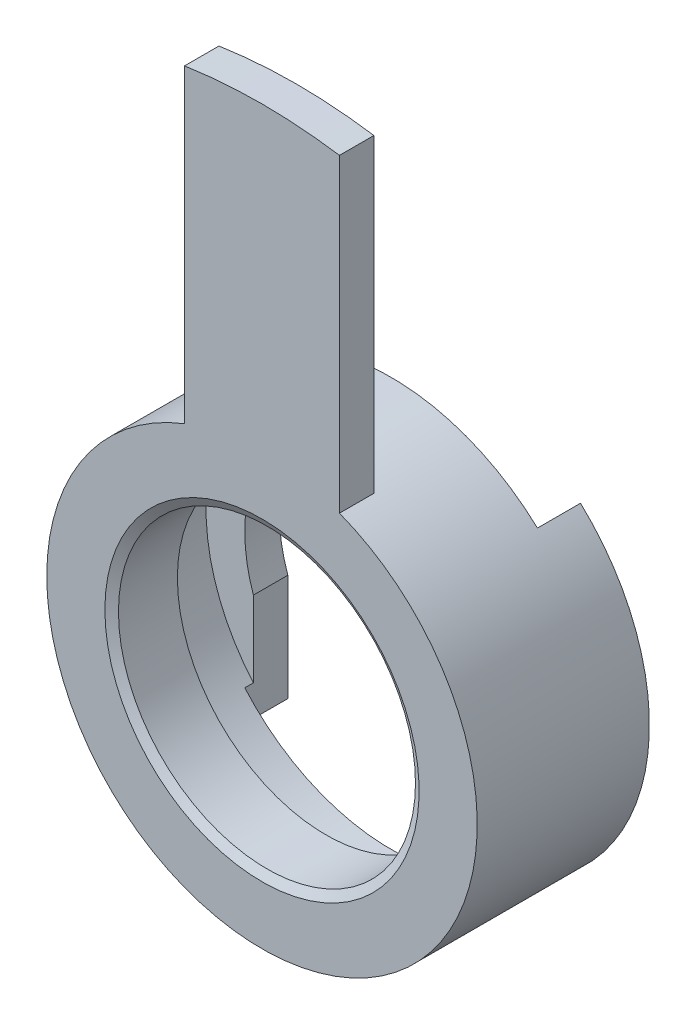
ISO-10303-21;
HEADER;
FILE_DESCRIPTION(('STEP AP214'),'2;1');
FILE_NAME('part.step','',(''),(''),'','','');
FILE_SCHEMA(('AUTOMOTIVE_DESIGN { 1 0 10303 214 1 1 1 1 }'));
ENDSEC;
DATA;
#1=APPLICATION_CONTEXT('core data for automotive mechanical design processes');
#2=APPLICATION_PROTOCOL_DEFINITION('international standard','automotive_design',2000,#1);
#3=PRODUCT_CONTEXT('',#1,'mechanical');
#4=PRODUCT('Part','Part','',(#3));
#5=PRODUCT_RELATED_PRODUCT_CATEGORY('part','',(#4));
#6=PRODUCT_DEFINITION_FORMATION('','',#4);
#7=PRODUCT_DEFINITION_CONTEXT('part definition',#1,'design');
#8=PRODUCT_DEFINITION('design','',#6,#7);
#9=PRODUCT_DEFINITION_SHAPE('','',#8);
#10=(LENGTH_UNIT() NAMED_UNIT(*) SI_UNIT(.MILLI.,.METRE.));
#11=(NAMED_UNIT(*) PLANE_ANGLE_UNIT() SI_UNIT($,.RADIAN.));
#12=(NAMED_UNIT(*) SI_UNIT($,.STERADIAN.) SOLID_ANGLE_UNIT());
#13=UNCERTAINTY_MEASURE_WITH_UNIT(LENGTH_MEASURE(1.E-05),#10,'distance_accuracy_value','');
#14=(GEOMETRIC_REPRESENTATION_CONTEXT(3) GLOBAL_UNCERTAINTY_ASSIGNED_CONTEXT((#13)) GLOBAL_UNIT_ASSIGNED_CONTEXT((#10,
#11,#12)) REPRESENTATION_CONTEXT('',''));
#15=CARTESIAN_POINT('',(0.,0.,0.));
#16=DIRECTION('',(0.,0.,1.));
#17=DIRECTION('',(1.,0.,0.));
#18=AXIS2_PLACEMENT_3D('',#15,#16,#17);
#19=CARTESIAN_POINT('',(0.,0.,0.));
#20=DIRECTION('',(0.,0.,1.));
#21=DIRECTION('',(1.,0.,0.));
#22=AXIS2_PLACEMENT_3D('',#19,#20,#21);
#23=CYLINDRICAL_SURFACE('',#22,25.);
#24=CARTESIAN_POINT('',(0.,0.,-4.));
#25=DIRECTION('',(0.,0.,1.));
#26=DIRECTION('',(1.,0.,0.));
#27=AXIS2_PLACEMENT_3D('',#24,#25,#26);
#28=CIRCLE('',#27,25.);
#29=CARTESIAN_POINT('',(9.,23.3238075793812,-4.));
#30=VERTEX_POINT('',#29);
#31=CARTESIAN_POINT('',(-9.,23.3238075793812,-4.));
#32=VERTEX_POINT('',#31);
#33=EDGE_CURVE('E247',#30,#32,#28,.T.);
#34=ORIENTED_EDGE('',*,*,#33,.F.);
#35=DIRECTION('',(0.,0.,1.));
#36=VECTOR('',#35,1.);
#37=CARTESIAN_POINT('',(9.,23.3238075793812,-5.));
#38=LINE('',#37,#36);
#39=CARTESIAN_POINT('',(9.,23.3238075793812,0.));
#40=VERTEX_POINT('',#39);
#41=EDGE_CURVE('E157',#30,#40,#38,.T.);
#42=ORIENTED_EDGE('',*,*,#41,.T.);
#43=CARTESIAN_POINT('',(0.,0.,0.));
#44=DIRECTION('',(0.,0.,1.));
#45=DIRECTION('',(1.,0.,0.));
#46=AXIS2_PLACEMENT_3D('',#43,#44,#45);
#47=CIRCLE('',#46,25.);
#48=CARTESIAN_POINT('',(-9.,23.3238075793812,0.));
#49=VERTEX_POINT('',#48);
#50=EDGE_CURVE('E155',#49,#40,#47,.T.);
#51=ORIENTED_EDGE('',*,*,#50,.F.);
#52=DIRECTION('',(0.,0.,1.));
#53=VECTOR('',#52,1.);
#54=CARTESIAN_POINT('',(-9.,23.3238075793812,-5.));
#55=LINE('',#54,#53);
#56=EDGE_CURVE('E144',#32,#49,#55,.T.);
#57=ORIENTED_EDGE('',*,*,#56,.F.);
#58=EDGE_LOOP('',(#34,#42,#51,#57));
#59=FACE_BOUND('',#58,.T.);
#60=DIRECTION('',(0.,0.,-1.));
#61=VECTOR('',#60,1.);
#62=CARTESIAN_POINT('',(-17.,-18.3303027798234,-15.));
#63=LINE('',#62,#61);
#64=CARTESIAN_POINT('',(-17.,-18.3303027798234,-15.));
#65=VERTEX_POINT('',#64);
#66=CARTESIAN_POINT('',(-17.,-18.3303027798234,-20.));
#67=VERTEX_POINT('',#66);
#68=EDGE_CURVE('E184',#65,#67,#63,.T.);
#69=ORIENTED_EDGE('',*,*,#68,.F.);
#70=CARTESIAN_POINT('',(0.,0.,-15.));
#71=DIRECTION('',(0.,0.,-1.));
#72=DIRECTION('',(-1.,0.,0.));
#73=AXIS2_PLACEMENT_3D('',#70,#71,#72);
#74=CIRCLE('',#73,25.);
#75=CARTESIAN_POINT('',(17.,-18.3303027798234,-15.));
#76=VERTEX_POINT('',#75);
#77=EDGE_CURVE('E178',#76,#65,#74,.T.);
#78=ORIENTED_EDGE('',*,*,#77,.F.);
#79=DIRECTION('',(0.,0.,-1.));
#80=VECTOR('',#79,1.);
#81=CARTESIAN_POINT('',(17.,-18.3303027798234,-15.));
#82=LINE('',#81,#80);
#83=CARTESIAN_POINT('',(17.,-18.3303027798234,-20.));
#84=VERTEX_POINT('',#83);
#85=EDGE_CURVE('E187',#76,#84,#82,.T.);
#86=ORIENTED_EDGE('',*,*,#85,.T.);
#87=CARTESIAN_POINT('',(0.,0.,-20.));
#88=DIRECTION('',(0.,0.,1.));
#89=DIRECTION('',(1.,0.,0.));
#90=AXIS2_PLACEMENT_3D('',#87,#88,#89);
#91=CIRCLE('',#90,25.);
#92=CARTESIAN_POINT('',(17.,18.3303027798234,-20.));
#93=VERTEX_POINT('',#92);
#94=EDGE_CURVE('E243',#84,#93,#91,.T.);
#95=ORIENTED_EDGE('',*,*,#94,.T.);
#96=DIRECTION('',(0.,0.,-1.));
#97=VECTOR('',#96,1.);
#98=CARTESIAN_POINT('',(17.,18.3303027798234,-15.));
#99=LINE('',#98,#97);
#100=CARTESIAN_POINT('',(17.,18.3303027798234,-15.));
#101=VERTEX_POINT('',#100);
#102=EDGE_CURVE('E219',#101,#93,#99,.T.);
#103=ORIENTED_EDGE('',*,*,#102,.F.);
#104=CARTESIAN_POINT('',(0.,0.,-15.));
#105=DIRECTION('',(0.,0.,-1.));
#106=DIRECTION('',(-1.,0.,0.));
#107=AXIS2_PLACEMENT_3D('',#104,#105,#106);
#108=CIRCLE('',#107,25.);
#109=CARTESIAN_POINT('',(-17.,18.3303027798234,-15.));
#110=VERTEX_POINT('',#109);
#111=EDGE_CURVE('E202',#110,#101,#108,.T.);
#112=ORIENTED_EDGE('',*,*,#111,.F.);
#113=DIRECTION('',(0.,0.,-1.));
#114=VECTOR('',#113,1.);
#115=CARTESIAN_POINT('',(-17.,18.3303027798234,-15.));
#116=LINE('',#115,#114);
#117=CARTESIAN_POINT('',(-17.,18.3303027798234,-20.));
#118=VERTEX_POINT('',#117);
#119=EDGE_CURVE('E208',#110,#118,#116,.T.);
#120=ORIENTED_EDGE('',*,*,#119,.T.);
#121=EDGE_CURVE('E244',#118,#67,#91,.T.);
#122=ORIENTED_EDGE('',*,*,#121,.T.);
#123=EDGE_LOOP('',(#69,#78,#86,#95,#103,#112,#120,#122));
#124=FACE_BOUND('',#123,.T.);
#125=ADVANCED_FACE('F33',(#59,#124),#23,.T.);
#126=CARTESIAN_POINT('',(0.,25.,-20.));
#127=DIRECTION('',(0.,0.,1.));
#128=DIRECTION('',(1.,0.,0.));
#129=AXIS2_PLACEMENT_3D('',#126,#127,#128);
#130=PLANE('',#129);
#131=DIRECTION('',(0.,-1.,0.));
#132=VECTOR('',#131,1.);
#133=CARTESIAN_POINT('',(-17.,0.,-20.));
#134=LINE('',#133,#132);
#135=CARTESIAN_POINT('',(-17.,-5.91607978309959,-20.));
#136=VERTEX_POINT('',#135);
#137=EDGE_CURVE('E170',#136,#67,#134,.T.);
#138=ORIENTED_EDGE('',*,*,#137,.T.);
#139=ORIENTED_EDGE('',*,*,#121,.F.);
#140=DIRECTION('',(0.,-1.,0.));
#141=VECTOR('',#140,1.);
#142=CARTESIAN_POINT('',(-17.,0.,-20.));
#143=LINE('',#142,#141);
#144=CARTESIAN_POINT('',(-17.,5.91607978309959,-20.));
#145=VERTEX_POINT('',#144);
#146=EDGE_CURVE('E198',#118,#145,#143,.T.);
#147=ORIENTED_EDGE('',*,*,#146,.T.);
#148=CARTESIAN_POINT('',(0.,0.,-20.));
#149=DIRECTION('',(0.,0.,1.));
#150=DIRECTION('',(1.,0.,0.));
#151=AXIS2_PLACEMENT_3D('',#148,#149,#150);
#152=CIRCLE('',#151,18.);
#153=EDGE_CURVE('E240',#145,#136,#152,.T.);
#154=ORIENTED_EDGE('',*,*,#153,.T.);
#155=EDGE_LOOP('',(#138,#139,#147,#154));
#156=FACE_BOUND('',#155,.T.);
#157=ADVANCED_FACE('F298',(#156),#130,.F.);
#158=CARTESIAN_POINT('',(0.,0.,0.));
#159=DIRECTION('',(0.,0.,1.));
#160=DIRECTION('',(1.,0.,0.));
#161=AXIS2_PLACEMENT_3D('',#158,#159,#160);
#162=CYLINDRICAL_SURFACE('',#161,18.);
#163=DIRECTION('',(0.,0.,-1.));
#164=VECTOR('',#163,1.);
#165=CARTESIAN_POINT('',(-17.,-5.91607978309959,-15.));
#166=LINE('',#165,#164);
#167=CARTESIAN_POINT('',(-17.,-5.91607978309959,-16.));
#168=VERTEX_POINT('',#167);
#169=EDGE_CURVE('E180',#168,#136,#166,.T.);
#170=ORIENTED_EDGE('',*,*,#169,.T.);
#171=ORIENTED_EDGE('',*,*,#153,.F.);
#172=DIRECTION('',(0.,0.,-1.));
#173=VECTOR('',#172,1.);
#174=CARTESIAN_POINT('',(-17.,5.91607978309959,-15.));
#175=LINE('',#174,#173);
#176=CARTESIAN_POINT('',(-17.,5.91607978309959,-16.));
#177=VERTEX_POINT('',#176);
#178=EDGE_CURVE('E213',#177,#145,#175,.T.);
#179=ORIENTED_EDGE('',*,*,#178,.F.);
#180=CARTESIAN_POINT('',(0.,0.,-16.));
#181=DIRECTION('',(0.,0.,1.));
#182=DIRECTION('',(1.,0.,0.));
#183=AXIS2_PLACEMENT_3D('',#180,#181,#182);
#184=CIRCLE('',#183,18.);
#185=EDGE_CURVE('E236',#177,#168,#184,.T.);
#186=ORIENTED_EDGE('',*,*,#185,.T.);
#187=EDGE_LOOP('',(#170,#171,#179,#186));
#188=FACE_BOUND('',#187,.T.);
#189=ADVANCED_FACE('F302',(#188),#162,.F.);
#190=CARTESIAN_POINT('',(0.,18.,-16.));
#191=DIRECTION('',(0.,0.,-1.));
#192=DIRECTION('',(-1.,0.,0.));
#193=AXIS2_PLACEMENT_3D('',#190,#191,#192);
#194=PLANE('',#193);
#195=DIRECTION('',(0.,-1.,0.));
#196=VECTOR('',#195,1.);
#197=CARTESIAN_POINT('',(-17.,18.,-16.));
#198=LINE('',#197,#196);
#199=CARTESIAN_POINT('',(-17.,-14.7394029729837,-16.));
#200=VERTEX_POINT('',#199);
#201=EDGE_CURVE('E196',#168,#200,#198,.T.);
#202=ORIENTED_EDGE('',*,*,#201,.F.);
#203=ORIENTED_EDGE('',*,*,#185,.F.);
#204=DIRECTION('',(0.,-1.,0.));
#205=VECTOR('',#204,1.);
#206=CARTESIAN_POINT('',(-17.,18.,-16.));
#207=LINE('',#206,#205);
#208=CARTESIAN_POINT('',(-17.,14.7394029729837,-16.));
#209=VERTEX_POINT('',#208);
#210=EDGE_CURVE('E226',#209,#177,#207,.T.);
#211=ORIENTED_EDGE('',*,*,#210,.F.);
#212=CARTESIAN_POINT('',(0.,0.,-16.));
#213=DIRECTION('',(0.,0.,1.));
#214=DIRECTION('',(1.,0.,0.));
#215=AXIS2_PLACEMENT_3D('',#212,#213,#214);
#216=CIRCLE('',#215,22.5);
#217=EDGE_CURVE('E232',#209,#200,#216,.T.);
#218=ORIENTED_EDGE('',*,*,#217,.T.);
#219=EDGE_LOOP('',(#202,#203,#211,#218));
#220=FACE_BOUND('',#219,.T.);
#221=ADVANCED_FACE('F305',(#220),#194,.F.);
#222=CARTESIAN_POINT('',(0.,0.,0.));
#223=DIRECTION('',(0.,0.,1.));
#224=DIRECTION('',(1.,0.,0.));
#225=AXIS2_PLACEMENT_3D('',#222,#223,#224);
#226=CYLINDRICAL_SURFACE('',#225,22.5);
#227=CARTESIAN_POINT('',(0.,0.,-7.99999999999999));
#228=DIRECTION('',(0.,0.,1.));
#229=DIRECTION('',(1.,0.,0.));
#230=AXIS2_PLACEMENT_3D('',#227,#228,#229);
#231=CIRCLE('',#230,22.5);
#232=CARTESIAN_POINT('',(22.5,0.,-7.99999999999999));
#233=VERTEX_POINT('',#232);
#234=EDGE_CURVE('E228',#233,#233,#231,.T.);
#235=ORIENTED_EDGE('',*,*,#234,.T.);
#236=EDGE_LOOP('',(#235));
#237=FACE_BOUND('',#236,.T.);
#238=DIRECTION('',(0.,0.,1.));
#239=VECTOR('',#238,1.);
#240=CARTESIAN_POINT('',(-17.,-14.7394029729837,0.));
#241=LINE('',#240,#239);
#242=CARTESIAN_POINT('',(-17.,-14.7394029729837,-15.));
#243=VERTEX_POINT('',#242);
#244=EDGE_CURVE('E277',#200,#243,#241,.T.);
#245=ORIENTED_EDGE('',*,*,#244,.F.);
#246=ORIENTED_EDGE('',*,*,#217,.F.);
#247=DIRECTION('',(0.,0.,1.));
#248=VECTOR('',#247,1.);
#249=CARTESIAN_POINT('',(-17.,14.7394029729837,0.));
#250=LINE('',#249,#248);
#251=CARTESIAN_POINT('',(-17.,14.7394029729837,-15.));
#252=VERTEX_POINT('',#251);
#253=EDGE_CURVE('E270',#252,#209,#250,.F.);
#254=ORIENTED_EDGE('',*,*,#253,.F.);
#255=CARTESIAN_POINT('',(0.,0.,-15.));
#256=DIRECTION('',(0.,0.,-1.));
#257=DIRECTION('',(-1.,0.,0.));
#258=AXIS2_PLACEMENT_3D('',#255,#256,#257);
#259=CIRCLE('',#258,22.5);
#260=CARTESIAN_POINT('',(17.,14.7394029729837,-15.));
#261=VERTEX_POINT('',#260);
#262=EDGE_CURVE('E265',#261,#252,#259,.F.);
#263=ORIENTED_EDGE('',*,*,#262,.F.);
#264=DIRECTION('',(0.,0.,1.));
#265=VECTOR('',#264,1.);
#266=CARTESIAN_POINT('',(17.,14.7394029729837,0.));
#267=LINE('',#266,#265);
#268=CARTESIAN_POINT('',(17.,14.7394029729837,-16.));
#269=VERTEX_POINT('',#268);
#270=EDGE_CURVE('E267',#261,#269,#267,.F.);
#271=ORIENTED_EDGE('',*,*,#270,.T.);
#272=CARTESIAN_POINT('',(17.,-14.7394029729837,-16.));
#273=VERTEX_POINT('',#272);
#274=EDGE_CURVE('E231',#273,#269,#216,.T.);
#275=ORIENTED_EDGE('',*,*,#274,.F.);
#276=DIRECTION('',(0.,0.,1.));
#277=VECTOR('',#276,1.);
#278=CARTESIAN_POINT('',(17.,-14.7394029729837,0.));
#279=LINE('',#278,#277);
#280=CARTESIAN_POINT('',(17.,-14.7394029729837,-15.));
#281=VERTEX_POINT('',#280);
#282=EDGE_CURVE('E274',#273,#281,#279,.T.);
#283=ORIENTED_EDGE('',*,*,#282,.T.);
#284=CARTESIAN_POINT('',(0.,0.,-15.));
#285=DIRECTION('',(0.,0.,-1.));
#286=DIRECTION('',(-1.,0.,0.));
#287=AXIS2_PLACEMENT_3D('',#284,#285,#286);
#288=CIRCLE('',#287,22.5);
#289=EDGE_CURVE('E272',#243,#281,#288,.F.);
#290=ORIENTED_EDGE('',*,*,#289,.F.);
#291=EDGE_LOOP('',(#245,#246,#254,#263,#271,#275,#283,#290));
#292=FACE_BOUND('',#291,.T.);
#293=ADVANCED_FACE('F285',(#237,#292),#226,.F.);
#294=ORIENTED_EDGE('',*,*,#94,.F.);
#295=DIRECTION('',(0.,-1.,0.));
#296=VECTOR('',#295,1.);
#297=CARTESIAN_POINT('',(17.,0.,-20.));
#298=LINE('',#297,#296);
#299=CARTESIAN_POINT('',(17.,-5.91607978309959,-20.));
#300=VERTEX_POINT('',#299);
#301=EDGE_CURVE('E176',#300,#84,#298,.T.);
#302=ORIENTED_EDGE('',*,*,#301,.F.);
#303=CARTESIAN_POINT('',(17.,5.91607978309959,-20.));
#304=VERTEX_POINT('',#303);
#305=EDGE_CURVE('E239',#300,#304,#152,.T.);
#306=ORIENTED_EDGE('',*,*,#305,.T.);
#307=DIRECTION('',(0.,-1.,0.));
#308=VECTOR('',#307,1.);
#309=CARTESIAN_POINT('',(17.,0.,-20.));
#310=LINE('',#309,#308);
#311=EDGE_CURVE('E203',#93,#304,#310,.T.);
#312=ORIENTED_EDGE('',*,*,#311,.F.);
#313=EDGE_LOOP('',(#294,#302,#306,#312));
#314=FACE_BOUND('',#313,.T.);
#315=ADVANCED_FACE('F322',(#314),#130,.F.);
#316=ORIENTED_EDGE('',*,*,#305,.F.);
#317=DIRECTION('',(0.,0.,-1.));
#318=VECTOR('',#317,1.);
#319=CARTESIAN_POINT('',(17.,-5.91607978309959,-15.));
#320=LINE('',#319,#318);
#321=CARTESIAN_POINT('',(17.,-5.91607978309959,-16.));
#322=VERTEX_POINT('',#321);
#323=EDGE_CURVE('E190',#322,#300,#320,.T.);
#324=ORIENTED_EDGE('',*,*,#323,.F.);
#325=CARTESIAN_POINT('',(17.,5.91607978309959,-16.));
#326=VERTEX_POINT('',#325);
#327=EDGE_CURVE('E235',#322,#326,#184,.T.);
#328=ORIENTED_EDGE('',*,*,#327,.T.);
#329=DIRECTION('',(0.,0.,-1.));
#330=VECTOR('',#329,1.);
#331=CARTESIAN_POINT('',(17.,5.91607978309959,-15.));
#332=LINE('',#331,#330);
#333=EDGE_CURVE('E216',#326,#304,#332,.T.);
#334=ORIENTED_EDGE('',*,*,#333,.T.);
#335=EDGE_LOOP('',(#316,#324,#328,#334));
#336=FACE_BOUND('',#335,.T.);
#337=ADVANCED_FACE('F326',(#336),#162,.F.);
#338=ORIENTED_EDGE('',*,*,#327,.F.);
#339=DIRECTION('',(0.,-1.,0.));
#340=VECTOR('',#339,1.);
#341=CARTESIAN_POINT('',(17.,18.,-16.));
#342=LINE('',#341,#340);
#343=EDGE_CURVE('E186',#322,#273,#342,.T.);
#344=ORIENTED_EDGE('',*,*,#343,.T.);
#345=ORIENTED_EDGE('',*,*,#274,.T.);
#346=DIRECTION('',(0.,-1.,0.));
#347=VECTOR('',#346,1.);
#348=CARTESIAN_POINT('',(17.,18.,-16.));
#349=LINE('',#348,#347);
#350=EDGE_CURVE('E215',#269,#326,#349,.T.);
#351=ORIENTED_EDGE('',*,*,#350,.T.);
#352=EDGE_LOOP('',(#338,#344,#345,#351));
#353=FACE_BOUND('',#352,.T.);
#354=ADVANCED_FACE('F330',(#353),#194,.F.);
#355=CARTESIAN_POINT('',(0.,0.,0.));
#356=DIRECTION('',(0.,0.,1.));
#357=DIRECTION('',(1.,0.,0.));
#358=AXIS2_PLACEMENT_3D('',#355,#356,#357);
#359=CYLINDRICAL_SURFACE('',#358,17.25);
#360=CARTESIAN_POINT('',(0.,0.,-7.42264973081038));
#361=DIRECTION('',(0.,0.,1.));
#362=DIRECTION('',(1.,0.,0.));
#363=AXIS2_PLACEMENT_3D('',#360,#361,#362);
#364=CIRCLE('',#363,17.25);
#365=CARTESIAN_POINT('',(17.25,0.,-7.42264973081038));
#366=VERTEX_POINT('',#365);
#367=EDGE_CURVE('E259',#366,#366,#364,.F.);
#368=ORIENTED_EDGE('',*,*,#367,.T.);
#369=EDGE_LOOP('',(#368));
#370=FACE_BOUND('',#369,.T.);
#371=CARTESIAN_POINT('',(0.,0.,-0.577350269189602));
#372=DIRECTION('',(0.,0.,-1.));
#373=DIRECTION('',(-1.,0.,0.));
#374=AXIS2_PLACEMENT_3D('',#371,#372,#373);
#375=CIRCLE('',#374,17.25);
#376=CARTESIAN_POINT('',(-17.25,0.,-0.577350269189602));
#377=VERTEX_POINT('',#376);
#378=EDGE_CURVE('E256',#377,#377,#375,.F.);
#379=ORIENTED_EDGE('',*,*,#378,.T.);
#380=EDGE_LOOP('',(#379));
#381=FACE_BOUND('',#380,.T.);
#382=ADVANCED_FACE('F332',(#370,#381),#359,.F.);
#383=CARTESIAN_POINT('',(0.,17.25,0.));
#384=DIRECTION('',(0.,0.,-1.));
#385=DIRECTION('',(-1.,0.,0.));
#386=AXIS2_PLACEMENT_3D('',#383,#384,#385);
#387=PLANE('',#386);
#388=CARTESIAN_POINT('',(0.,0.,0.));
#389=DIRECTION('',(0.,0.,-1.));
#390=DIRECTION('',(-1.,0.,0.));
#391=AXIS2_PLACEMENT_3D('',#388,#389,#390);
#392=CIRCLE('',#391,18.25);
#393=CARTESIAN_POINT('',(-18.25,0.,0.));
#394=VERTEX_POINT('',#393);
#395=EDGE_CURVE('E262',#394,#394,#392,.T.);
#396=ORIENTED_EDGE('',*,*,#395,.T.);
#397=EDGE_LOOP('',(#396));
#398=FACE_BOUND('',#397,.T.);
#399=ORIENTED_EDGE('',*,*,#50,.T.);
#400=DIRECTION('',(0.,-1.,0.));
#401=VECTOR('',#400,1.);
#402=CARTESIAN_POINT('',(9.,-132.141421356237,0.));
#403=LINE('',#402,#401);
#404=CARTESIAN_POINT('',(9.,59.3211597998556,0.));
#405=VERTEX_POINT('',#404);
#406=EDGE_CURVE('E152',#405,#40,#403,.T.);
#407=ORIENTED_EDGE('',*,*,#406,.F.);
#408=CARTESIAN_POINT('',(0.,0.,0.));
#409=DIRECTION('',(0.,0.,1.));
#410=DIRECTION('',(1.,0.,0.));
#411=AXIS2_PLACEMENT_3D('',#408,#409,#410);
#412=CIRCLE('',#411,60.);
#413=CARTESIAN_POINT('',(-9.,59.3211597998556,0.));
#414=VERTEX_POINT('',#413);
#415=EDGE_CURVE('E165',#405,#414,#412,.T.);
#416=ORIENTED_EDGE('',*,*,#415,.T.);
#417=DIRECTION('',(0.,-1.,0.));
#418=VECTOR('',#417,1.);
#419=CARTESIAN_POINT('',(-9.,-132.141421356237,0.));
#420=LINE('',#419,#418);
#421=EDGE_CURVE('E148',#414,#49,#420,.T.);
#422=ORIENTED_EDGE('',*,*,#421,.T.);
#423=EDGE_LOOP('',(#399,#407,#416,#422));
#424=FACE_BOUND('',#423,.T.);
#425=ADVANCED_FACE('F163',(#398,#424),#387,.F.);
#426=CARTESIAN_POINT('',(0.,0.,0.));
#427=DIRECTION('',(0.,0.,1.));
#428=DIRECTION('',(1.,0.,0.));
#429=AXIS2_PLACEMENT_3D('',#426,#427,#428);
#430=CYLINDRICAL_SURFACE('',#429,60.);
#431=ORIENTED_EDGE('',*,*,#415,.F.);
#432=DIRECTION('',(0.,0.,1.));
#433=VECTOR('',#432,1.);
#434=CARTESIAN_POINT('',(9.,59.3211597998556,-5.));
#435=LINE('',#434,#433);
#436=CARTESIAN_POINT('',(9.,59.3211597998556,-4.));
#437=VERTEX_POINT('',#436);
#438=EDGE_CURVE('E171',#437,#405,#435,.T.);
#439=ORIENTED_EDGE('',*,*,#438,.F.);
#440=CARTESIAN_POINT('',(0.,0.,-4.));
#441=DIRECTION('',(0.,0.,1.));
#442=DIRECTION('',(1.,0.,0.));
#443=AXIS2_PLACEMENT_3D('',#440,#441,#442);
#444=CIRCLE('',#443,60.);
#445=CARTESIAN_POINT('',(-9.,59.3211597998556,-4.));
#446=VERTEX_POINT('',#445);
#447=EDGE_CURVE('E249',#437,#446,#444,.T.);
#448=ORIENTED_EDGE('',*,*,#447,.T.);
#449=DIRECTION('',(0.,0.,1.));
#450=VECTOR('',#449,1.);
#451=CARTESIAN_POINT('',(-9.,59.3211597998556,-5.));
#452=LINE('',#451,#450);
#453=EDGE_CURVE('E48',#446,#414,#452,.T.);
#454=ORIENTED_EDGE('',*,*,#453,.T.);
#455=EDGE_LOOP('',(#431,#439,#448,#454));
#456=FACE_BOUND('',#455,.T.);
#457=ADVANCED_FACE('F354',(#456),#430,.T.);
#458=CARTESIAN_POINT('',(0.,60.,-4.));
#459=DIRECTION('',(0.,0.,1.));
#460=DIRECTION('',(1.,0.,0.));
#461=AXIS2_PLACEMENT_3D('',#458,#459,#460);
#462=PLANE('',#461);
#463=ORIENTED_EDGE('',*,*,#447,.F.);
#464=DIRECTION('',(0.,-1.,0.));
#465=VECTOR('',#464,1.);
#466=CARTESIAN_POINT('',(9.,60.,-4.));
#467=LINE('',#466,#465);
#468=EDGE_CURVE('E11',#437,#30,#467,.T.);
#469=ORIENTED_EDGE('',*,*,#468,.T.);
#470=ORIENTED_EDGE('',*,*,#33,.T.);
#471=DIRECTION('',(0.,-1.,0.));
#472=VECTOR('',#471,1.);
#473=CARTESIAN_POINT('',(-9.,60.,-4.));
#474=LINE('',#473,#472);
#475=EDGE_CURVE('E41',#446,#32,#474,.T.);
#476=ORIENTED_EDGE('',*,*,#475,.F.);
#477=EDGE_LOOP('',(#463,#469,#470,#476));
#478=FACE_BOUND('',#477,.T.);
#479=ADVANCED_FACE('F350',(#478),#462,.F.);
#480=CARTESIAN_POINT('',(0.,22.5,-7.99999999999999));
#481=DIRECTION('',(0.,0.,1.));
#482=DIRECTION('',(1.,0.,0.));
#483=AXIS2_PLACEMENT_3D('',#480,#481,#482);
#484=PLANE('',#483);
#485=CARTESIAN_POINT('',(0.,0.,-7.99999999999999));
#486=DIRECTION('',(0.,0.,1.));
#487=DIRECTION('',(1.,0.,0.));
#488=AXIS2_PLACEMENT_3D('',#485,#486,#487);
#489=CIRCLE('',#488,18.25);
#490=CARTESIAN_POINT('',(18.25,0.,-7.99999999999999));
#491=VERTEX_POINT('',#490);
#492=EDGE_CURVE('E253',#491,#491,#489,.T.);
#493=ORIENTED_EDGE('',*,*,#492,.T.);
#494=EDGE_LOOP('',(#493));
#495=FACE_BOUND('',#494,.T.);
#496=ORIENTED_EDGE('',*,*,#234,.F.);
#497=EDGE_LOOP('',(#496));
#498=FACE_BOUND('',#497,.T.);
#499=ADVANCED_FACE('F353',(#495,#498),#484,.F.);
#500=CARTESIAN_POINT('',(0.,0.,-7.99999999999999));
#501=DIRECTION('',(0.,0.,-1.));
#502=DIRECTION('',(-1.,0.,0.));
#503=AXIS2_PLACEMENT_3D('',#500,#501,#502);
#504=CONICAL_SURFACE('',#503,18.25,1.04719755119661);
#505=ORIENTED_EDGE('',*,*,#367,.F.);
#506=EDGE_LOOP('',(#505));
#507=FACE_BOUND('',#506,.T.);
#508=ORIENTED_EDGE('',*,*,#492,.F.);
#509=EDGE_LOOP('',(#508));
#510=FACE_BOUND('',#509,.T.);
#511=ADVANCED_FACE('F361',(#507,#510),#504,.F.);
#512=CARTESIAN_POINT('',(0.,0.,-0.577350269189602));
#513=DIRECTION('',(0.,0.,1.));
#514=DIRECTION('',(1.,0.,0.));
#515=AXIS2_PLACEMENT_3D('',#512,#513,#514);
#516=CONICAL_SURFACE('',#515,17.25,1.04719755119661);
#517=ORIENTED_EDGE('',*,*,#395,.F.);
#518=EDGE_LOOP('',(#517));
#519=FACE_BOUND('',#518,.T.);
#520=ORIENTED_EDGE('',*,*,#378,.F.);
#521=EDGE_LOOP('',(#520));
#522=FACE_BOUND('',#521,.T.);
#523=ADVANCED_FACE('F35',(#519,#522),#516,.F.);
#524=CARTESIAN_POINT('',(-17.,0.,-15.));
#525=DIRECTION('',(1.,0.,0.));
#526=DIRECTION('',(0.,0.,-1.));
#527=AXIS2_PLACEMENT_3D('',#524,#525,#526);
#528=PLANE('',#527);
#529=ORIENTED_EDGE('',*,*,#210,.T.);
#530=ORIENTED_EDGE('',*,*,#178,.T.);
#531=ORIENTED_EDGE('',*,*,#146,.F.);
#532=ORIENTED_EDGE('',*,*,#119,.F.);
#533=DIRECTION('',(0.,-1.,0.));
#534=VECTOR('',#533,1.);
#535=CARTESIAN_POINT('',(-17.,0.,-15.));
#536=LINE('',#535,#534);
#537=EDGE_CURVE('E199',#110,#252,#536,.T.);
#538=ORIENTED_EDGE('',*,*,#537,.T.);
#539=ORIENTED_EDGE('',*,*,#253,.T.);
#540=EDGE_LOOP('',(#529,#530,#531,#532,#538,#539));
#541=FACE_BOUND('',#540,.T.);
#542=ADVANCED_FACE('F310',(#541),#528,.T.);
#543=CARTESIAN_POINT('',(17.,0.,-15.));
#544=DIRECTION('',(1.,0.,0.));
#545=DIRECTION('',(0.,0.,-1.));
#546=AXIS2_PLACEMENT_3D('',#543,#544,#545);
#547=PLANE('',#546);
#548=ORIENTED_EDGE('',*,*,#270,.F.);
#549=DIRECTION('',(0.,-1.,0.));
#550=VECTOR('',#549,1.);
#551=CARTESIAN_POINT('',(17.,0.,-15.));
#552=LINE('',#551,#550);
#553=EDGE_CURVE('E206',#101,#261,#552,.T.);
#554=ORIENTED_EDGE('',*,*,#553,.F.);
#555=ORIENTED_EDGE('',*,*,#102,.T.);
#556=ORIENTED_EDGE('',*,*,#311,.T.);
#557=ORIENTED_EDGE('',*,*,#333,.F.);
#558=ORIENTED_EDGE('',*,*,#350,.F.);
#559=EDGE_LOOP('',(#548,#554,#555,#556,#557,#558));
#560=FACE_BOUND('',#559,.T.);
#561=ADVANCED_FACE('F319',(#560),#547,.F.);
#562=CARTESIAN_POINT('',(-55.1414213562373,0.,-15.));
#563=DIRECTION('',(0.,0.,-1.));
#564=DIRECTION('',(-1.,0.,0.));
#565=AXIS2_PLACEMENT_3D('',#562,#563,#564);
#566=PLANE('',#565);
#567=ORIENTED_EDGE('',*,*,#262,.T.);
#568=ORIENTED_EDGE('',*,*,#537,.F.);
#569=ORIENTED_EDGE('',*,*,#111,.T.);
#570=ORIENTED_EDGE('',*,*,#553,.T.);
#571=EDGE_LOOP('',(#567,#568,#569,#570));
#572=FACE_BOUND('',#571,.T.);
#573=ADVANCED_FACE('F314',(#572),#566,.T.);
#574=CARTESIAN_POINT('',(-17.,0.,-15.));
#575=DIRECTION('',(1.,0.,0.));
#576=DIRECTION('',(0.,0.,-1.));
#577=AXIS2_PLACEMENT_3D('',#574,#575,#576);
#578=PLANE('',#577);
#579=ORIENTED_EDGE('',*,*,#201,.T.);
#580=ORIENTED_EDGE('',*,*,#244,.T.);
#581=DIRECTION('',(0.,-1.,0.));
#582=VECTOR('',#581,1.);
#583=CARTESIAN_POINT('',(-17.,0.,-15.));
#584=LINE('',#583,#582);
#585=EDGE_CURVE('E56',#243,#65,#584,.T.);
#586=ORIENTED_EDGE('',*,*,#585,.T.);
#587=ORIENTED_EDGE('',*,*,#68,.T.);
#588=ORIENTED_EDGE('',*,*,#137,.F.);
#589=ORIENTED_EDGE('',*,*,#169,.F.);
#590=EDGE_LOOP('',(#579,#580,#586,#587,#588,#589));
#591=FACE_BOUND('',#590,.T.);
#592=ADVANCED_FACE('F281',(#591),#578,.T.);
#593=CARTESIAN_POINT('',(17.,0.,-15.));
#594=DIRECTION('',(1.,0.,0.));
#595=DIRECTION('',(0.,0.,-1.));
#596=AXIS2_PLACEMENT_3D('',#593,#594,#595);
#597=PLANE('',#596);
#598=ORIENTED_EDGE('',*,*,#323,.T.);
#599=ORIENTED_EDGE('',*,*,#301,.T.);
#600=ORIENTED_EDGE('',*,*,#85,.F.);
#601=DIRECTION('',(0.,-1.,0.));
#602=VECTOR('',#601,1.);
#603=CARTESIAN_POINT('',(17.,0.,-15.));
#604=LINE('',#603,#602);
#605=EDGE_CURVE('E175',#281,#76,#604,.T.);
#606=ORIENTED_EDGE('',*,*,#605,.F.);
#607=ORIENTED_EDGE('',*,*,#282,.F.);
#608=ORIENTED_EDGE('',*,*,#343,.F.);
#609=EDGE_LOOP('',(#598,#599,#600,#606,#607,#608));
#610=FACE_BOUND('',#609,.T.);
#611=ADVANCED_FACE('F291',(#610),#597,.F.);
#612=CARTESIAN_POINT('',(-55.1414213562373,0.,-15.));
#613=DIRECTION('',(0.,0.,-1.));
#614=DIRECTION('',(-1.,0.,0.));
#615=AXIS2_PLACEMENT_3D('',#612,#613,#614);
#616=PLANE('',#615);
#617=ORIENTED_EDGE('',*,*,#289,.T.);
#618=ORIENTED_EDGE('',*,*,#605,.T.);
#619=ORIENTED_EDGE('',*,*,#77,.T.);
#620=ORIENTED_EDGE('',*,*,#585,.F.);
#621=EDGE_LOOP('',(#617,#618,#619,#620));
#622=FACE_BOUND('',#621,.T.);
#623=ADVANCED_FACE('F288',(#622),#616,.T.);
#624=CARTESIAN_POINT('',(9.,-132.141421356237,-5.));
#625=DIRECTION('',(-1.,0.,0.));
#626=DIRECTION('',(0.,0.,1.));
#627=AXIS2_PLACEMENT_3D('',#624,#625,#626);
#628=PLANE('',#627);
#629=ORIENTED_EDGE('',*,*,#438,.T.);
#630=ORIENTED_EDGE('',*,*,#406,.T.);
#631=ORIENTED_EDGE('',*,*,#41,.F.);
#632=ORIENTED_EDGE('',*,*,#468,.F.);
#633=EDGE_LOOP('',(#629,#630,#631,#632));
#634=FACE_BOUND('',#633,.T.);
#635=ADVANCED_FACE('F394',(#634),#628,.F.);
#636=CARTESIAN_POINT('',(-9.,-132.141421356237,-5.));
#637=DIRECTION('',(-1.,0.,0.));
#638=DIRECTION('',(0.,0.,1.));
#639=AXIS2_PLACEMENT_3D('',#636,#637,#638);
#640=PLANE('',#639);
#641=ORIENTED_EDGE('',*,*,#475,.T.);
#642=ORIENTED_EDGE('',*,*,#56,.T.);
#643=ORIENTED_EDGE('',*,*,#421,.F.);
#644=ORIENTED_EDGE('',*,*,#453,.F.);
#645=EDGE_LOOP('',(#641,#642,#643,#644));
#646=FACE_BOUND('',#645,.T.);
#647=ADVANCED_FACE('F146',(#646),#640,.T.);
#648=CLOSED_SHELL('',(#125,#157,#189,#221,#293,#315,#337,#354,#382,#425,#457,#479,#499,#511,
#523,#542,#561,#573,#592,#611,#623,#635,#647));
#649=MANIFOLD_SOLID_BREP('B2',#648);
#650=ADVANCED_BREP_SHAPE_REPRESENTATION('',(#18,#649),#14);
#651=SHAPE_DEFINITION_REPRESENTATION(#9,#650);
ENDSEC;
END-ISO-10303-21;
